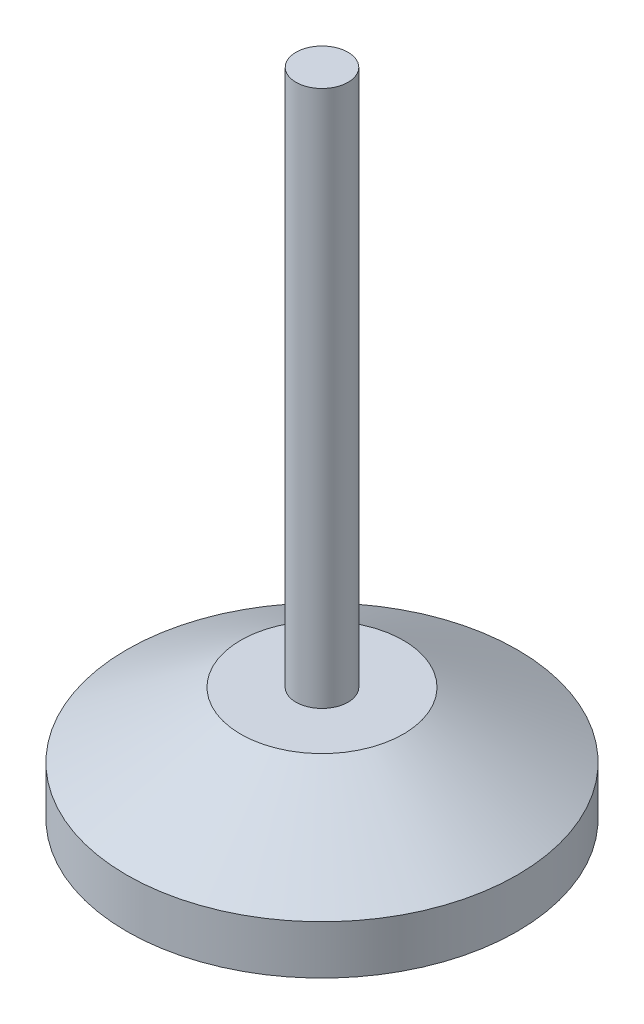
ISO-10303-21;
HEADER;
FILE_DESCRIPTION(('STEP AP214'),'2;1');
FILE_NAME('part.step','',(''),(''),'','','');
FILE_SCHEMA(('AUTOMOTIVE_DESIGN { 1 0 10303 214 1 1 1 1 }'));
ENDSEC;
DATA;
#1=APPLICATION_CONTEXT('core data for automotive mechanical design processes');
#2=APPLICATION_PROTOCOL_DEFINITION('international standard','automotive_design',2000,#1);
#3=PRODUCT_CONTEXT('',#1,'mechanical');
#4=PRODUCT('Part','Part','',(#3));
#5=PRODUCT_RELATED_PRODUCT_CATEGORY('part','',(#4));
#6=PRODUCT_DEFINITION_FORMATION('','',#4);
#7=PRODUCT_DEFINITION_CONTEXT('part definition',#1,'design');
#8=PRODUCT_DEFINITION('design','',#6,#7);
#9=PRODUCT_DEFINITION_SHAPE('','',#8);
#10=(LENGTH_UNIT() NAMED_UNIT(*) SI_UNIT(.MILLI.,.METRE.));
#11=(NAMED_UNIT(*) PLANE_ANGLE_UNIT() SI_UNIT($,.RADIAN.));
#12=(NAMED_UNIT(*) SI_UNIT($,.STERADIAN.) SOLID_ANGLE_UNIT());
#13=UNCERTAINTY_MEASURE_WITH_UNIT(LENGTH_MEASURE(1.E-05),#10,'distance_accuracy_value','');
#14=(GEOMETRIC_REPRESENTATION_CONTEXT(3) GLOBAL_UNCERTAINTY_ASSIGNED_CONTEXT((#13)) GLOBAL_UNIT_ASSIGNED_CONTEXT((#10,
#11,#12)) REPRESENTATION_CONTEXT('',''));
#15=CARTESIAN_POINT('',(0.,0.,0.));
#16=DIRECTION('',(0.,0.,1.));
#17=DIRECTION('',(1.,0.,0.));
#18=AXIS2_PLACEMENT_3D('',#15,#16,#17);
#19=CARTESIAN_POINT('',(0.,0.,0.));
#20=DIRECTION('',(0.,-1.,0.));
#21=DIRECTION('',(0.,0.,-1.));
#22=AXIS2_PLACEMENT_3D('',#19,#20,#21);
#23=PLANE('',#22);
#24=CARTESIAN_POINT('',(0.,0.,0.));
#25=DIRECTION('',(0.,1.,0.));
#26=DIRECTION('',(0.,0.,1.));
#27=AXIS2_PLACEMENT_3D('',#24,#25,#26);
#28=CIRCLE('',#27,60.);
#29=CARTESIAN_POINT('',(0.,0.,60.));
#30=VERTEX_POINT('',#29);
#31=EDGE_CURVE('E10',#30,#30,#28,.T.);
#32=ORIENTED_EDGE('',*,*,#31,.F.);
#33=EDGE_LOOP('',(#32));
#34=FACE_BOUND('',#33,.T.);
#35=ADVANCED_FACE('F34',(#34),#23,.T.);
#36=CARTESIAN_POINT('',(0.,0.,0.));
#37=DIRECTION('',(0.,1.,0.));
#38=DIRECTION('',(0.,0.,1.));
#39=AXIS2_PLACEMENT_3D('',#36,#37,#38);
#40=CYLINDRICAL_SURFACE('',#39,60.);
#41=ORIENTED_EDGE('',*,*,#31,.T.);
#42=EDGE_LOOP('',(#41));
#43=FACE_BOUND('',#42,.T.);
#44=CARTESIAN_POINT('',(0.,15.,0.));
#45=DIRECTION('',(0.,1.,0.));
#46=DIRECTION('',(0.,0.,1.));
#47=AXIS2_PLACEMENT_3D('',#44,#45,#46);
#48=CIRCLE('',#47,60.);
#49=CARTESIAN_POINT('',(0.,15.,60.));
#50=VERTEX_POINT('',#49);
#51=EDGE_CURVE('E40',#50,#50,#48,.T.);
#52=ORIENTED_EDGE('',*,*,#51,.F.);
#53=EDGE_LOOP('',(#52));
#54=FACE_BOUND('',#53,.T.);
#55=ADVANCED_FACE('F73',(#43,#54),#40,.T.);
#56=CARTESIAN_POINT('',(0.,35.,0.));
#57=DIRECTION('',(0.,-1.,0.));
#58=DIRECTION('',(0.,0.,-1.));
#59=AXIS2_PLACEMENT_3D('',#56,#57,#58);
#60=CONICAL_SURFACE('',#59,25.,1.05165021254837);
#61=ORIENTED_EDGE('',*,*,#51,.T.);
#62=EDGE_LOOP('',(#61));
#63=FACE_BOUND('',#62,.T.);
#64=CARTESIAN_POINT('',(0.,35.,0.));
#65=DIRECTION('',(0.,1.,0.));
#66=DIRECTION('',(0.,0.,1.));
#67=AXIS2_PLACEMENT_3D('',#64,#65,#66);
#68=CIRCLE('',#67,25.);
#69=CARTESIAN_POINT('',(0.,35.,25.));
#70=VERTEX_POINT('',#69);
#71=EDGE_CURVE('E44',#70,#70,#68,.T.);
#72=ORIENTED_EDGE('',*,*,#71,.F.);
#73=EDGE_LOOP('',(#72));
#74=FACE_BOUND('',#73,.T.);
#75=ADVANCED_FACE('F69',(#63,#74),#60,.T.);
#76=CARTESIAN_POINT('',(-25.,35.,0.));
#77=DIRECTION('',(0.,1.,0.));
#78=DIRECTION('',(0.,0.,1.));
#79=AXIS2_PLACEMENT_3D('',#76,#77,#78);
#80=PLANE('',#79);
#81=ORIENTED_EDGE('',*,*,#71,.T.);
#82=EDGE_LOOP('',(#81));
#83=FACE_BOUND('',#82,.T.);
#84=CARTESIAN_POINT('',(0.,35.,0.));
#85=DIRECTION('',(0.,1.,0.));
#86=DIRECTION('',(0.,0.,1.));
#87=AXIS2_PLACEMENT_3D('',#84,#85,#86);
#88=CIRCLE('',#87,8.);
#89=CARTESIAN_POINT('',(0.,35.,8.));
#90=VERTEX_POINT('',#89);
#91=EDGE_CURVE('E48',#90,#90,#88,.T.);
#92=ORIENTED_EDGE('',*,*,#91,.F.);
#93=EDGE_LOOP('',(#92));
#94=FACE_BOUND('',#93,.T.);
#95=ADVANCED_FACE('F61',(#83,#94),#80,.T.);
#96=CARTESIAN_POINT('',(0.,0.,0.));
#97=DIRECTION('',(0.,1.,0.));
#98=DIRECTION('',(0.,0.,1.));
#99=AXIS2_PLACEMENT_3D('',#96,#97,#98);
#100=CYLINDRICAL_SURFACE('',#99,8.);
#101=ORIENTED_EDGE('',*,*,#91,.T.);
#102=EDGE_LOOP('',(#101));
#103=FACE_BOUND('',#102,.T.);
#104=CARTESIAN_POINT('',(0.,200.,0.));
#105=DIRECTION('',(0.,1.,0.));
#106=DIRECTION('',(0.,0.,1.));
#107=AXIS2_PLACEMENT_3D('',#104,#105,#106);
#108=CIRCLE('',#107,8.);
#109=CARTESIAN_POINT('',(0.,200.,8.));
#110=VERTEX_POINT('',#109);
#111=EDGE_CURVE('E53',#110,#110,#108,.T.);
#112=ORIENTED_EDGE('',*,*,#111,.F.);
#113=EDGE_LOOP('',(#112));
#114=FACE_BOUND('',#113,.T.);
#115=ADVANCED_FACE('F59',(#103,#114),#100,.T.);
#116=CARTESIAN_POINT('',(-8.,200.,0.));
#117=DIRECTION('',(0.,1.,0.));
#118=DIRECTION('',(0.,0.,1.));
#119=AXIS2_PLACEMENT_3D('',#116,#117,#118);
#120=PLANE('',#119);
#121=ORIENTED_EDGE('',*,*,#111,.T.);
#122=EDGE_LOOP('',(#121));
#123=FACE_BOUND('',#122,.T.);
#124=ADVANCED_FACE('F57',(#123),#120,.T.);
#125=CLOSED_SHELL('',(#35,#55,#75,#95,#115,#124));
#126=MANIFOLD_SOLID_BREP('B2',#125);
#127=ADVANCED_BREP_SHAPE_REPRESENTATION('',(#18,#126),#14);
#128=SHAPE_DEFINITION_REPRESENTATION(#9,#127);
ENDSEC;
END-ISO-10303-21;
